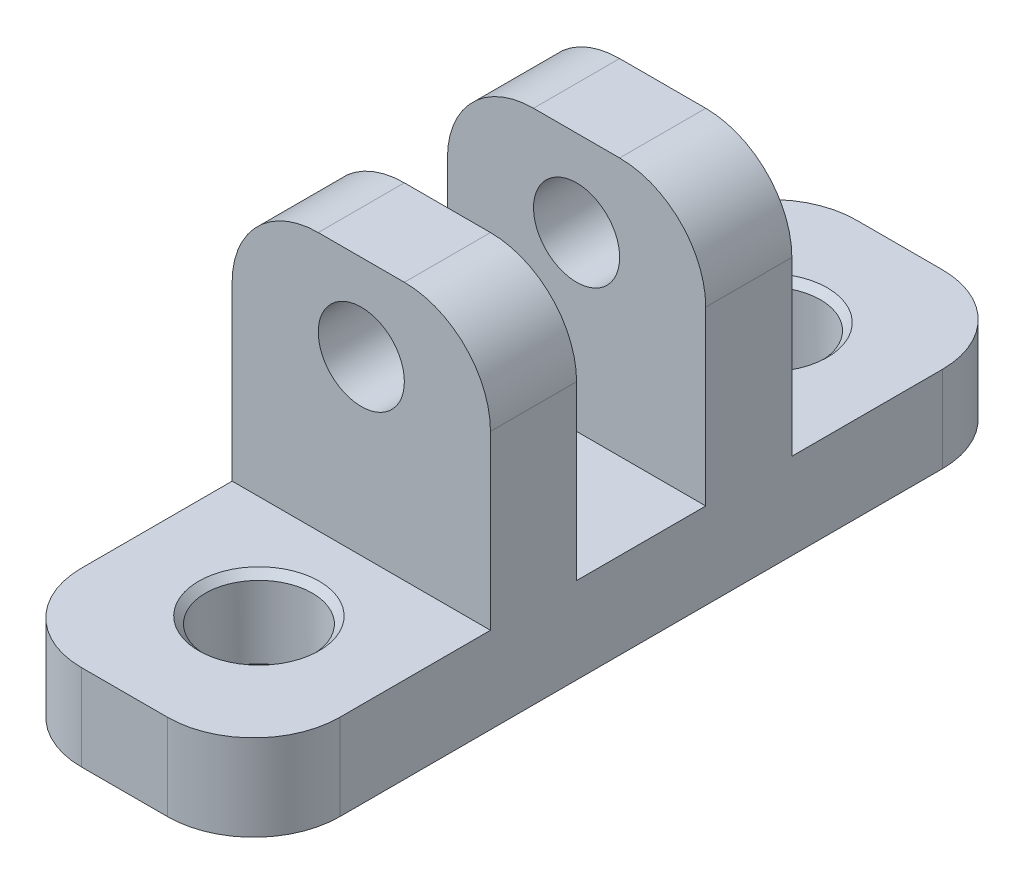
ISO-10303-21;
HEADER;
FILE_DESCRIPTION(('STEP AP214'),'2;1');
FILE_NAME('part.step','',(''),(''),'','','');
FILE_SCHEMA(('AUTOMOTIVE_DESIGN { 1 0 10303 214 1 1 1 1 }'));
ENDSEC;
DATA;
#1=APPLICATION_CONTEXT('core data for automotive mechanical design processes');
#2=APPLICATION_PROTOCOL_DEFINITION('international standard','automotive_design',2000,#1);
#3=PRODUCT_CONTEXT('',#1,'mechanical');
#4=PRODUCT('Part','Part','',(#3));
#5=PRODUCT_RELATED_PRODUCT_CATEGORY('part','',(#4));
#6=PRODUCT_DEFINITION_FORMATION('','',#4);
#7=PRODUCT_DEFINITION_CONTEXT('part definition',#1,'design');
#8=PRODUCT_DEFINITION('design','',#6,#7);
#9=PRODUCT_DEFINITION_SHAPE('','',#8);
#10=(LENGTH_UNIT() NAMED_UNIT(*) SI_UNIT(.MILLI.,.METRE.));
#11=(NAMED_UNIT(*) PLANE_ANGLE_UNIT() SI_UNIT($,.RADIAN.));
#12=(NAMED_UNIT(*) SI_UNIT($,.STERADIAN.) SOLID_ANGLE_UNIT());
#13=UNCERTAINTY_MEASURE_WITH_UNIT(LENGTH_MEASURE(1.E-05),#10,'distance_accuracy_value','');
#14=(GEOMETRIC_REPRESENTATION_CONTEXT(3) GLOBAL_UNCERTAINTY_ASSIGNED_CONTEXT((#13)) GLOBAL_UNIT_ASSIGNED_CONTEXT((#10,
#11,#12)) REPRESENTATION_CONTEXT('',''));
#15=CARTESIAN_POINT('',(0.,0.,0.));
#16=DIRECTION('',(0.,0.,1.));
#17=DIRECTION('',(1.,0.,0.));
#18=AXIS2_PLACEMENT_3D('',#15,#16,#17);
#19=CARTESIAN_POINT('',(0.,25.4,0.));
#20=DIRECTION('',(0.,1.,0.));
#21=DIRECTION('',(0.,0.,1.));
#22=AXIS2_PLACEMENT_3D('',#19,#20,#21);
#23=PLANE('',#22);
#24=DIRECTION('',(1.,0.,0.));
#25=VECTOR('',#24,1.);
#26=CARTESIAN_POINT('',(60.325,25.4,4.76249999999999));
#27=LINE('',#26,#25);
#28=CARTESIAN_POINT('',(66.675,25.4,4.76249999999999));
#29=VERTEX_POINT('',#28);
#30=CARTESIAN_POINT('',(73.025,25.4,4.76249999999999));
#31=VERTEX_POINT('',#30);
#32=EDGE_CURVE('E209',#29,#31,#27,.T.);
#33=ORIENTED_EDGE('',*,*,#32,.F.);
#34=DIRECTION('',(0.,0.,1.));
#35=VECTOR('',#34,1.);
#36=CARTESIAN_POINT('',(66.675,25.4,11.1125));
#37=LINE('',#36,#35);
#38=CARTESIAN_POINT('',(66.675,25.4,11.1125));
#39=VERTEX_POINT('',#38);
#40=EDGE_CURVE('E327',#29,#39,#37,.T.);
#41=ORIENTED_EDGE('',*,*,#40,.T.);
#42=DIRECTION('',(1.,0.,0.));
#43=VECTOR('',#42,1.);
#44=CARTESIAN_POINT('',(60.325,25.4,11.1125));
#45=LINE('',#44,#43);
#46=CARTESIAN_POINT('',(73.025,25.4,11.1125));
#47=VERTEX_POINT('',#46);
#48=EDGE_CURVE('E243',#39,#47,#45,.T.);
#49=ORIENTED_EDGE('',*,*,#48,.T.);
#50=DIRECTION('',(0.,0.,-1.));
#51=VECTOR('',#50,1.);
#52=CARTESIAN_POINT('',(73.025,25.4,4.76249999999999));
#53=LINE('',#52,#51);
#54=EDGE_CURVE('E324',#47,#31,#53,.T.);
#55=ORIENTED_EDGE('',*,*,#54,.T.);
#56=EDGE_LOOP('',(#33,#41,#49,#55));
#57=FACE_BOUND('',#56,.T.);
#58=ADVANCED_FACE('F33',(#57),#23,.T.);
#59=CARTESIAN_POINT('',(60.325,25.4,-28.575));
#60=DIRECTION('',(1.,0.,0.));
#61=DIRECTION('',(0.,0.,-1.));
#62=AXIS2_PLACEMENT_3D('',#59,#60,#61);
#63=PLANE('',#62);
#64=DIRECTION('',(0.,0.,-1.));
#65=VECTOR('',#64,1.);
#66=CARTESIAN_POINT('',(60.325,6.35,-28.575));
#67=LINE('',#66,#65);
#68=CARTESIAN_POINT('',(60.325,6.35,-11.1125));
#69=VERTEX_POINT('',#68);
#70=CARTESIAN_POINT('',(60.325,6.35,-22.225));
#71=VERTEX_POINT('',#70);
#72=EDGE_CURVE('E219',#69,#71,#67,.T.);
#73=ORIENTED_EDGE('',*,*,#72,.T.);
#74=DIRECTION('',(0.,-1.,0.));
#75=VECTOR('',#74,1.);
#76=CARTESIAN_POINT('',(60.325,25.4,-22.225));
#77=LINE('',#76,#75);
#78=CARTESIAN_POINT('',(60.325,0.,-22.225));
#79=VERTEX_POINT('',#78);
#80=EDGE_CURVE('E272',#71,#79,#77,.T.);
#81=ORIENTED_EDGE('',*,*,#80,.T.);
#82=DIRECTION('',(0.,0.,1.));
#83=VECTOR('',#82,1.);
#84=CARTESIAN_POINT('',(60.325,0.,-28.575));
#85=LINE('',#84,#83);
#86=CARTESIAN_POINT('',(60.325,0.,22.225));
#87=VERTEX_POINT('',#86);
#88=EDGE_CURVE('E245',#79,#87,#85,.T.);
#89=ORIENTED_EDGE('',*,*,#88,.T.);
#90=DIRECTION('',(0.,-1.,0.));
#91=VECTOR('',#90,1.);
#92=CARTESIAN_POINT('',(60.325,25.4,22.225));
#93=LINE('',#92,#91);
#94=CARTESIAN_POINT('',(60.325,6.35,22.225));
#95=VERTEX_POINT('',#94);
#96=EDGE_CURVE('E270',#87,#95,#93,.F.);
#97=ORIENTED_EDGE('',*,*,#96,.T.);
#98=DIRECTION('',(0.,0.,-1.));
#99=VECTOR('',#98,1.);
#100=CARTESIAN_POINT('',(60.325,6.35,28.575));
#101=LINE('',#100,#99);
#102=CARTESIAN_POINT('',(60.325,6.35,11.1125));
#103=VERTEX_POINT('',#102);
#104=EDGE_CURVE('E235',#95,#103,#101,.T.);
#105=ORIENTED_EDGE('',*,*,#104,.T.);
#106=DIRECTION('',(0.,1.,0.));
#107=VECTOR('',#106,1.);
#108=CARTESIAN_POINT('',(60.325,25.4,11.1125));
#109=LINE('',#108,#107);
#110=CARTESIAN_POINT('',(60.325,19.05,11.1125));
#111=VERTEX_POINT('',#110);
#112=EDGE_CURVE('E237',#103,#111,#109,.T.);
#113=ORIENTED_EDGE('',*,*,#112,.T.);
#114=DIRECTION('',(0.,0.,1.));
#115=VECTOR('',#114,1.);
#116=CARTESIAN_POINT('',(60.325,19.05,4.76249999999999));
#117=LINE('',#116,#115);
#118=CARTESIAN_POINT('',(60.325,19.05,4.7625));
#119=VERTEX_POINT('',#118);
#120=EDGE_CURVE('E181',#111,#119,#117,.F.);
#121=ORIENTED_EDGE('',*,*,#120,.T.);
#122=DIRECTION('',(0.,-1.,0.));
#123=VECTOR('',#122,1.);
#124=CARTESIAN_POINT('',(60.325,25.4,4.76249999999999));
#125=LINE('',#124,#123);
#126=CARTESIAN_POINT('',(60.325,6.35,4.76250000000004));
#127=VERTEX_POINT('',#126);
#128=EDGE_CURVE('E173',#119,#127,#125,.T.);
#129=ORIENTED_EDGE('',*,*,#128,.T.);
#130=DIRECTION('',(0.,0.,-1.));
#131=VECTOR('',#130,1.);
#132=CARTESIAN_POINT('',(60.325,6.35,4.76250000000004));
#133=LINE('',#132,#131);
#134=CARTESIAN_POINT('',(60.325,6.35,-4.76249999999996));
#135=VERTEX_POINT('',#134);
#136=EDGE_CURVE('E179',#127,#135,#133,.T.);
#137=ORIENTED_EDGE('',*,*,#136,.T.);
#138=DIRECTION('',(0.,1.,0.));
#139=VECTOR('',#138,1.);
#140=CARTESIAN_POINT('',(60.325,25.4,-4.76250000000001));
#141=LINE('',#140,#139);
#142=CARTESIAN_POINT('',(60.325,19.05,-4.76249999999999));
#143=VERTEX_POINT('',#142);
#144=EDGE_CURVE('E195',#135,#143,#141,.T.);
#145=ORIENTED_EDGE('',*,*,#144,.T.);
#146=DIRECTION('',(0.,0.,1.));
#147=VECTOR('',#146,1.);
#148=CARTESIAN_POINT('',(60.325,19.05,-11.1125));
#149=LINE('',#148,#147);
#150=CARTESIAN_POINT('',(60.325,19.05,-11.1125));
#151=VERTEX_POINT('',#150);
#152=EDGE_CURVE('E268',#143,#151,#149,.F.);
#153=ORIENTED_EDGE('',*,*,#152,.T.);
#154=DIRECTION('',(0.,-1.,0.));
#155=VECTOR('',#154,1.);
#156=CARTESIAN_POINT('',(60.325,25.4,-11.1125));
#157=LINE('',#156,#155);
#158=EDGE_CURVE('E217',#151,#69,#157,.T.);
#159=ORIENTED_EDGE('',*,*,#158,.T.);
#160=EDGE_LOOP('',(#73,#81,#89,#97,#105,#113,#121,#129,#137,#145,#153,#159));
#161=FACE_BOUND('',#160,.T.);
#162=ADVANCED_FACE('F176',(#161),#63,.F.);
#163=CARTESIAN_POINT('',(60.325,25.4,28.575));
#164=DIRECTION('',(0.,0.,-1.));
#165=DIRECTION('',(-1.,0.,0.));
#166=AXIS2_PLACEMENT_3D('',#163,#164,#165);
#167=PLANE('',#166);
#168=DIRECTION('',(1.,0.,0.));
#169=VECTOR('',#168,1.);
#170=CARTESIAN_POINT('',(60.325,6.35,28.575));
#171=LINE('',#170,#169);
#172=CARTESIAN_POINT('',(66.675,6.35,28.575));
#173=VERTEX_POINT('',#172);
#174=CARTESIAN_POINT('',(73.025,6.35,28.575));
#175=VERTEX_POINT('',#174);
#176=EDGE_CURVE('E240',#173,#175,#171,.T.);
#177=ORIENTED_EDGE('',*,*,#176,.F.);
#178=DIRECTION('',(0.,-1.,0.));
#179=VECTOR('',#178,1.);
#180=CARTESIAN_POINT('',(66.675,25.4,28.575));
#181=LINE('',#180,#179);
#182=CARTESIAN_POINT('',(66.675,0.,28.575));
#183=VERTEX_POINT('',#182);
#184=EDGE_CURVE('E303',#173,#183,#181,.T.);
#185=ORIENTED_EDGE('',*,*,#184,.T.);
#186=DIRECTION('',(1.,0.,0.));
#187=VECTOR('',#186,1.);
#188=CARTESIAN_POINT('',(60.325,0.,28.575));
#189=LINE('',#188,#187);
#190=CARTESIAN_POINT('',(73.025,0.,28.575));
#191=VERTEX_POINT('',#190);
#192=EDGE_CURVE('E253',#183,#191,#189,.T.);
#193=ORIENTED_EDGE('',*,*,#192,.T.);
#194=DIRECTION('',(0.,-1.,0.));
#195=VECTOR('',#194,1.);
#196=CARTESIAN_POINT('',(73.025,25.4,28.575));
#197=LINE('',#196,#195);
#198=EDGE_CURVE('E301',#191,#175,#197,.F.);
#199=ORIENTED_EDGE('',*,*,#198,.T.);
#200=EDGE_LOOP('',(#177,#185,#193,#199));
#201=FACE_BOUND('',#200,.T.);
#202=ADVANCED_FACE('F378',(#201),#167,.F.);
#203=CARTESIAN_POINT('',(79.375,25.4,-28.575));
#204=DIRECTION('',(-1.,0.,0.));
#205=DIRECTION('',(0.,0.,1.));
#206=AXIS2_PLACEMENT_3D('',#203,#204,#205);
#207=PLANE('',#206);
#208=DIRECTION('',(0.,0.,-1.));
#209=VECTOR('',#208,1.);
#210=CARTESIAN_POINT('',(79.375,0.,-28.575));
#211=LINE('',#210,#209);
#212=CARTESIAN_POINT('',(79.375,0.,22.225));
#213=VERTEX_POINT('',#212);
#214=CARTESIAN_POINT('',(79.375,0.,-22.225));
#215=VERTEX_POINT('',#214);
#216=EDGE_CURVE('E256',#213,#215,#211,.T.);
#217=ORIENTED_EDGE('',*,*,#216,.T.);
#218=DIRECTION('',(0.,-1.,0.));
#219=VECTOR('',#218,1.);
#220=CARTESIAN_POINT('',(79.375,25.4,-22.225));
#221=LINE('',#220,#219);
#222=CARTESIAN_POINT('',(79.375,6.35,-22.225));
#223=VERTEX_POINT('',#222);
#224=EDGE_CURVE('E299',#215,#223,#221,.F.);
#225=ORIENTED_EDGE('',*,*,#224,.T.);
#226=DIRECTION('',(0.,0.,-1.));
#227=VECTOR('',#226,1.);
#228=CARTESIAN_POINT('',(79.375,6.35,-28.575));
#229=LINE('',#228,#227);
#230=CARTESIAN_POINT('',(79.375,6.35,-11.1125));
#231=VERTEX_POINT('',#230);
#232=EDGE_CURVE('E220',#231,#223,#229,.T.);
#233=ORIENTED_EDGE('',*,*,#232,.F.);
#234=DIRECTION('',(0.,-1.,0.));
#235=VECTOR('',#234,1.);
#236=CARTESIAN_POINT('',(79.375,25.4,-11.1125));
#237=LINE('',#236,#235);
#238=CARTESIAN_POINT('',(79.375,19.05,-11.1125));
#239=VERTEX_POINT('',#238);
#240=EDGE_CURVE('E223',#239,#231,#237,.T.);
#241=ORIENTED_EDGE('',*,*,#240,.F.);
#242=DIRECTION('',(0.,0.,-1.));
#243=VECTOR('',#242,1.);
#244=CARTESIAN_POINT('',(79.375,19.05,-4.76250000000001));
#245=LINE('',#244,#243);
#246=CARTESIAN_POINT('',(79.375,19.05,-4.76249999999999));
#247=VERTEX_POINT('',#246);
#248=EDGE_CURVE('E294',#239,#247,#245,.F.);
#249=ORIENTED_EDGE('',*,*,#248,.T.);
#250=DIRECTION('',(0.,1.,0.));
#251=VECTOR('',#250,1.);
#252=CARTESIAN_POINT('',(79.375,25.4,-4.76250000000001));
#253=LINE('',#252,#251);
#254=CARTESIAN_POINT('',(79.375,6.35,-4.76249999999996));
#255=VERTEX_POINT('',#254);
#256=EDGE_CURVE('E184',#255,#247,#253,.T.);
#257=ORIENTED_EDGE('',*,*,#256,.F.);
#258=DIRECTION('',(0.,0.,-1.));
#259=VECTOR('',#258,1.);
#260=CARTESIAN_POINT('',(79.375,6.35,4.76250000000004));
#261=LINE('',#260,#259);
#262=CARTESIAN_POINT('',(79.375,6.35,4.76250000000004));
#263=VERTEX_POINT('',#262);
#264=EDGE_CURVE('E204',#263,#255,#261,.T.);
#265=ORIENTED_EDGE('',*,*,#264,.F.);
#266=DIRECTION('',(0.,-1.,0.));
#267=VECTOR('',#266,1.);
#268=CARTESIAN_POINT('',(79.375,25.4,4.76249999999999));
#269=LINE('',#268,#267);
#270=CARTESIAN_POINT('',(79.375,19.05,4.7625));
#271=VERTEX_POINT('',#270);
#272=EDGE_CURVE('E190',#271,#263,#269,.T.);
#273=ORIENTED_EDGE('',*,*,#272,.F.);
#274=DIRECTION('',(0.,0.,-1.));
#275=VECTOR('',#274,1.);
#276=CARTESIAN_POINT('',(79.375,19.05,11.1125));
#277=LINE('',#276,#275);
#278=CARTESIAN_POINT('',(79.375,19.05,11.1125));
#279=VERTEX_POINT('',#278);
#280=EDGE_CURVE('E292',#271,#279,#277,.F.);
#281=ORIENTED_EDGE('',*,*,#280,.T.);
#282=DIRECTION('',(0.,1.,0.));
#283=VECTOR('',#282,1.);
#284=CARTESIAN_POINT('',(79.375,25.4,11.1125));
#285=LINE('',#284,#283);
#286=CARTESIAN_POINT('',(79.375,6.35,11.1125));
#287=VERTEX_POINT('',#286);
#288=EDGE_CURVE('E238',#287,#279,#285,.T.);
#289=ORIENTED_EDGE('',*,*,#288,.F.);
#290=DIRECTION('',(0.,0.,-1.));
#291=VECTOR('',#290,1.);
#292=CARTESIAN_POINT('',(79.375,6.35,28.575));
#293=LINE('',#292,#291);
#294=CARTESIAN_POINT('',(79.375,6.35,22.225));
#295=VERTEX_POINT('',#294);
#296=EDGE_CURVE('E212',#295,#287,#293,.T.);
#297=ORIENTED_EDGE('',*,*,#296,.F.);
#298=DIRECTION('',(0.,-1.,0.));
#299=VECTOR('',#298,1.);
#300=CARTESIAN_POINT('',(79.375,25.4,22.225));
#301=LINE('',#300,#299);
#302=EDGE_CURVE('E296',#295,#213,#301,.T.);
#303=ORIENTED_EDGE('',*,*,#302,.T.);
#304=EDGE_LOOP('',(#217,#225,#233,#241,#249,#257,#265,#273,#281,#289,#297,#303));
#305=FACE_BOUND('',#304,.T.);
#306=ADVANCED_FACE('F394',(#305),#207,.F.);
#307=CARTESIAN_POINT('',(60.325,25.4,-28.575));
#308=DIRECTION('',(0.,0.,1.));
#309=DIRECTION('',(1.,0.,0.));
#310=AXIS2_PLACEMENT_3D('',#307,#308,#309);
#311=PLANE('',#310);
#312=DIRECTION('',(-1.,0.,0.));
#313=VECTOR('',#312,1.);
#314=CARTESIAN_POINT('',(60.325,0.,-28.575));
#315=LINE('',#314,#313);
#316=CARTESIAN_POINT('',(73.025,0.,-28.575));
#317=VERTEX_POINT('',#316);
#318=CARTESIAN_POINT('',(66.675,0.,-28.575));
#319=VERTEX_POINT('',#318);
#320=EDGE_CURVE('E259',#317,#319,#315,.T.);
#321=ORIENTED_EDGE('',*,*,#320,.T.);
#322=DIRECTION('',(0.,-1.,0.));
#323=VECTOR('',#322,1.);
#324=CARTESIAN_POINT('',(66.675,25.4,-28.575));
#325=LINE('',#324,#323);
#326=CARTESIAN_POINT('',(66.675,6.35,-28.575));
#327=VERTEX_POINT('',#326);
#328=EDGE_CURVE('E286',#319,#327,#325,.F.);
#329=ORIENTED_EDGE('',*,*,#328,.T.);
#330=DIRECTION('',(1.,0.,0.));
#331=VECTOR('',#330,1.);
#332=CARTESIAN_POINT('',(60.325,6.35,-28.575));
#333=LINE('',#332,#331);
#334=CARTESIAN_POINT('',(73.025,6.35,-28.575));
#335=VERTEX_POINT('',#334);
#336=EDGE_CURVE('E205',#327,#335,#333,.T.);
#337=ORIENTED_EDGE('',*,*,#336,.T.);
#338=DIRECTION('',(0.,-1.,0.));
#339=VECTOR('',#338,1.);
#340=CARTESIAN_POINT('',(73.025,25.4,-28.575));
#341=LINE('',#340,#339);
#342=EDGE_CURVE('E283',#335,#317,#341,.T.);
#343=ORIENTED_EDGE('',*,*,#342,.T.);
#344=EDGE_LOOP('',(#321,#329,#337,#343));
#345=FACE_BOUND('',#344,.T.);
#346=ADVANCED_FACE('F385',(#345),#311,.F.);
#347=DIRECTION('',(1.,0.,0.));
#348=VECTOR('',#347,1.);
#349=CARTESIAN_POINT('',(60.325,25.4,-4.76250000000001));
#350=LINE('',#349,#348);
#351=CARTESIAN_POINT('',(66.675,25.4,-4.76250000000001));
#352=VERTEX_POINT('',#351);
#353=CARTESIAN_POINT('',(73.025,25.4,-4.76250000000001));
#354=VERTEX_POINT('',#353);
#355=EDGE_CURVE('E213',#352,#354,#350,.T.);
#356=ORIENTED_EDGE('',*,*,#355,.T.);
#357=DIRECTION('',(0.,0.,-1.));
#358=VECTOR('',#357,1.);
#359=CARTESIAN_POINT('',(73.025,25.4,-11.1125));
#360=LINE('',#359,#358);
#361=CARTESIAN_POINT('',(73.025,25.4,-11.1125));
#362=VERTEX_POINT('',#361);
#363=EDGE_CURVE('E313',#354,#362,#360,.T.);
#364=ORIENTED_EDGE('',*,*,#363,.T.);
#365=DIRECTION('',(1.,0.,0.));
#366=VECTOR('',#365,1.);
#367=CARTESIAN_POINT('',(60.325,25.4,-11.1125));
#368=LINE('',#367,#366);
#369=CARTESIAN_POINT('',(66.675,25.4,-11.1125));
#370=VERTEX_POINT('',#369);
#371=EDGE_CURVE('E222',#370,#362,#368,.T.);
#372=ORIENTED_EDGE('',*,*,#371,.F.);
#373=DIRECTION('',(0.,0.,1.));
#374=VECTOR('',#373,1.);
#375=CARTESIAN_POINT('',(66.675,25.4,-4.76250000000001));
#376=LINE('',#375,#374);
#377=EDGE_CURVE('E310',#370,#352,#376,.T.);
#378=ORIENTED_EDGE('',*,*,#377,.T.);
#379=EDGE_LOOP('',(#356,#364,#372,#378));
#380=FACE_BOUND('',#379,.T.);
#381=ADVANCED_FACE('F374',(#380),#23,.T.);
#382=CARTESIAN_POINT('',(0.,0.,0.));
#383=DIRECTION('',(0.,1.,0.));
#384=DIRECTION('',(0.,0.,1.));
#385=AXIS2_PLACEMENT_3D('',#382,#383,#384);
#386=PLANE('',#385);
#387=CARTESIAN_POINT('',(69.9233705650656,0.,-18.7359106749715));
#388=DIRECTION('',(0.,1.,0.));
#389=DIRECTION('',(0.,0.,1.));
#390=AXIS2_PLACEMENT_3D('',#387,#388,#389);
#391=CIRCLE('',#390,4.445);
#392=CARTESIAN_POINT('',(69.9233705650656,0.,-14.2909106749715));
#393=VERTEX_POINT('',#392);
#394=EDGE_CURVE('E347',#393,#393,#391,.T.);
#395=ORIENTED_EDGE('',*,*,#394,.T.);
#396=EDGE_LOOP('',(#395));
#397=FACE_BOUND('',#396,.T.);
#398=CARTESIAN_POINT('',(69.9233705650656,0.,18.7359106749715));
#399=DIRECTION('',(0.,1.,0.));
#400=DIRECTION('',(0.,0.,1.));
#401=AXIS2_PLACEMENT_3D('',#398,#399,#400);
#402=CIRCLE('',#401,4.445);
#403=CARTESIAN_POINT('',(69.9233705650656,0.,23.1809106749715));
#404=VERTEX_POINT('',#403);
#405=EDGE_CURVE('E344',#404,#404,#402,.T.);
#406=ORIENTED_EDGE('',*,*,#405,.T.);
#407=EDGE_LOOP('',(#406));
#408=FACE_BOUND('',#407,.T.);
#409=ORIENTED_EDGE('',*,*,#88,.F.);
#410=CARTESIAN_POINT('',(66.675,0.,-22.225));
#411=DIRECTION('',(0.,1.,0.));
#412=DIRECTION('',(0.,0.,1.));
#413=AXIS2_PLACEMENT_3D('',#410,#411,#412);
#414=CIRCLE('',#413,6.35);
#415=EDGE_CURVE('E281',#79,#319,#414,.F.);
#416=ORIENTED_EDGE('',*,*,#415,.T.);
#417=ORIENTED_EDGE('',*,*,#320,.F.);
#418=CARTESIAN_POINT('',(73.025,0.,-22.225));
#419=DIRECTION('',(0.,1.,0.));
#420=DIRECTION('',(0.,0.,1.));
#421=AXIS2_PLACEMENT_3D('',#418,#419,#420);
#422=CIRCLE('',#421,6.35);
#423=EDGE_CURVE('E279',#317,#215,#422,.F.);
#424=ORIENTED_EDGE('',*,*,#423,.T.);
#425=ORIENTED_EDGE('',*,*,#216,.F.);
#426=CARTESIAN_POINT('',(73.025,0.,22.225));
#427=DIRECTION('',(0.,1.,0.));
#428=DIRECTION('',(0.,0.,1.));
#429=AXIS2_PLACEMENT_3D('',#426,#427,#428);
#430=CIRCLE('',#429,6.35);
#431=EDGE_CURVE('E275',#213,#191,#430,.F.);
#432=ORIENTED_EDGE('',*,*,#431,.T.);
#433=ORIENTED_EDGE('',*,*,#192,.F.);
#434=CARTESIAN_POINT('',(66.675,0.,22.225));
#435=DIRECTION('',(0.,1.,0.));
#436=DIRECTION('',(0.,0.,1.));
#437=AXIS2_PLACEMENT_3D('',#434,#435,#436);
#438=CIRCLE('',#437,6.35);
#439=EDGE_CURVE('E277',#183,#87,#438,.F.);
#440=ORIENTED_EDGE('',*,*,#439,.T.);
#441=EDGE_LOOP('',(#409,#416,#417,#424,#425,#432,#433,#440));
#442=FACE_BOUND('',#441,.T.);
#443=ADVANCED_FACE('F384',(#397,#408,#442),#386,.F.);
#444=CARTESIAN_POINT('',(60.325,25.4,11.1125));
#445=DIRECTION('',(0.,0.,-1.));
#446=DIRECTION('',(0.,1.,0.));
#447=AXIS2_PLACEMENT_3D('',#444,#445,#446);
#448=PLANE('',#447);
#449=CARTESIAN_POINT('',(69.85,19.05,11.1125000000001));
#450=DIRECTION('',(0.,0.,1.));
#451=DIRECTION('',(1.,0.,0.));
#452=AXIS2_PLACEMENT_3D('',#449,#450,#451);
#453=CIRCLE('',#452,3.175);
#454=CARTESIAN_POINT('',(73.025,19.05,11.1125000000001));
#455=VERTEX_POINT('',#454);
#456=EDGE_CURVE('E266',#455,#455,#453,.T.);
#457=ORIENTED_EDGE('',*,*,#456,.F.);
#458=EDGE_LOOP('',(#457));
#459=FACE_BOUND('',#458,.T.);
#460=ORIENTED_EDGE('',*,*,#48,.F.);
#461=CARTESIAN_POINT('',(66.675,19.05,11.1125));
#462=DIRECTION('',(0.,0.,-1.));
#463=DIRECTION('',(0.,1.,0.));
#464=AXIS2_PLACEMENT_3D('',#461,#462,#463);
#465=CIRCLE('',#464,6.35);
#466=EDGE_CURVE('E56',#39,#111,#465,.F.);
#467=ORIENTED_EDGE('',*,*,#466,.T.);
#468=ORIENTED_EDGE('',*,*,#112,.F.);
#469=DIRECTION('',(1.,0.,0.));
#470=VECTOR('',#469,1.);
#471=CARTESIAN_POINT('',(60.325,6.35,11.1125));
#472=LINE('',#471,#470);
#473=EDGE_CURVE('E246',#103,#287,#472,.T.);
#474=ORIENTED_EDGE('',*,*,#473,.T.);
#475=ORIENTED_EDGE('',*,*,#288,.T.);
#476=CARTESIAN_POINT('',(73.025,19.05,11.1125));
#477=DIRECTION('',(0.,0.,-1.));
#478=DIRECTION('',(0.,1.,0.));
#479=AXIS2_PLACEMENT_3D('',#476,#477,#478);
#480=CIRCLE('',#479,6.35);
#481=EDGE_CURVE('E48',#279,#47,#480,.F.);
#482=ORIENTED_EDGE('',*,*,#481,.T.);
#483=EDGE_LOOP('',(#460,#467,#468,#474,#475,#482));
#484=FACE_BOUND('',#483,.T.);
#485=ADVANCED_FACE('F392',(#459,#484),#448,.F.);
#486=CARTESIAN_POINT('',(60.325,6.35,28.575));
#487=DIRECTION('',(0.,-1.,0.));
#488=DIRECTION('',(0.,0.,-1.));
#489=AXIS2_PLACEMENT_3D('',#486,#487,#488);
#490=PLANE('',#489);
#491=CARTESIAN_POINT('',(69.9233705650656,6.35,18.7359106749715));
#492=DIRECTION('',(0.,-1.,0.));
#493=DIRECTION('',(0.,0.,-1.));
#494=AXIS2_PLACEMENT_3D('',#491,#492,#493);
#495=CIRCLE('',#494,4.445);
#496=CARTESIAN_POINT('',(69.9233705650656,6.35,14.2909106749715));
#497=VERTEX_POINT('',#496);
#498=EDGE_CURVE('E11',#497,#497,#495,.T.);
#499=ORIENTED_EDGE('',*,*,#498,.T.);
#500=EDGE_LOOP('',(#499));
#501=FACE_BOUND('',#500,.T.);
#502=ORIENTED_EDGE('',*,*,#104,.F.);
#503=CARTESIAN_POINT('',(66.675,6.35,22.225));
#504=DIRECTION('',(0.,-1.,0.));
#505=DIRECTION('',(0.,0.,-1.));
#506=AXIS2_PLACEMENT_3D('',#503,#504,#505);
#507=CIRCLE('',#506,6.35);
#508=EDGE_CURVE('E308',#95,#173,#507,.F.);
#509=ORIENTED_EDGE('',*,*,#508,.T.);
#510=ORIENTED_EDGE('',*,*,#176,.T.);
#511=CARTESIAN_POINT('',(73.025,6.35,22.225));
#512=DIRECTION('',(0.,-1.,0.));
#513=DIRECTION('',(0.,0.,-1.));
#514=AXIS2_PLACEMENT_3D('',#511,#512,#513);
#515=CIRCLE('',#514,6.35);
#516=EDGE_CURVE('E306',#175,#295,#515,.F.);
#517=ORIENTED_EDGE('',*,*,#516,.T.);
#518=ORIENTED_EDGE('',*,*,#296,.T.);
#519=ORIENTED_EDGE('',*,*,#473,.F.);
#520=EDGE_LOOP('',(#502,#509,#510,#517,#518,#519));
#521=FACE_BOUND('',#520,.T.);
#522=ADVANCED_FACE('F449',(#501,#521),#490,.F.);
#523=CARTESIAN_POINT('',(60.325,6.35,-28.575));
#524=DIRECTION('',(0.,-1.,0.));
#525=DIRECTION('',(0.,0.,-1.));
#526=AXIS2_PLACEMENT_3D('',#523,#524,#525);
#527=PLANE('',#526);
#528=CARTESIAN_POINT('',(69.9233705650656,6.35,-18.7359106749715));
#529=DIRECTION('',(0.,-1.,0.));
#530=DIRECTION('',(0.,0.,-1.));
#531=AXIS2_PLACEMENT_3D('',#528,#529,#530);
#532=CIRCLE('',#531,4.445);
#533=CARTESIAN_POINT('',(69.9233705650656,6.35,-23.1809106749715));
#534=VERTEX_POINT('',#533);
#535=EDGE_CURVE('E341',#534,#534,#532,.T.);
#536=ORIENTED_EDGE('',*,*,#535,.T.);
#537=EDGE_LOOP('',(#536));
#538=FACE_BOUND('',#537,.T.);
#539=ORIENTED_EDGE('',*,*,#336,.F.);
#540=CARTESIAN_POINT('',(66.675,6.35,-22.225));
#541=DIRECTION('',(0.,-1.,0.));
#542=DIRECTION('',(0.,0.,-1.));
#543=AXIS2_PLACEMENT_3D('',#540,#541,#542);
#544=CIRCLE('',#543,6.35);
#545=EDGE_CURVE('E290',#327,#71,#544,.F.);
#546=ORIENTED_EDGE('',*,*,#545,.T.);
#547=ORIENTED_EDGE('',*,*,#72,.F.);
#548=DIRECTION('',(1.,0.,0.));
#549=VECTOR('',#548,1.);
#550=CARTESIAN_POINT('',(60.325,6.35,-11.1125));
#551=LINE('',#550,#549);
#552=EDGE_CURVE('E230',#69,#231,#551,.T.);
#553=ORIENTED_EDGE('',*,*,#552,.T.);
#554=ORIENTED_EDGE('',*,*,#232,.T.);
#555=CARTESIAN_POINT('',(73.025,6.35,-22.225));
#556=DIRECTION('',(0.,-1.,0.));
#557=DIRECTION('',(0.,0.,-1.));
#558=AXIS2_PLACEMENT_3D('',#555,#556,#557);
#559=CIRCLE('',#558,6.35);
#560=EDGE_CURVE('E288',#223,#335,#559,.F.);
#561=ORIENTED_EDGE('',*,*,#560,.T.);
#562=EDGE_LOOP('',(#539,#546,#547,#553,#554,#561));
#563=FACE_BOUND('',#562,.T.);
#564=ADVANCED_FACE('F417',(#538,#563),#527,.F.);
#565=CARTESIAN_POINT('',(60.325,25.4,-11.1125));
#566=DIRECTION('',(0.,0.,1.));
#567=DIRECTION('',(0.,-1.,0.));
#568=AXIS2_PLACEMENT_3D('',#565,#566,#567);
#569=PLANE('',#568);
#570=CARTESIAN_POINT('',(69.85,19.05,-11.1125));
#571=DIRECTION('',(0.,0.,1.));
#572=DIRECTION('',(0.,-1.,0.));
#573=AXIS2_PLACEMENT_3D('',#570,#571,#572);
#574=CIRCLE('',#573,3.175);
#575=CARTESIAN_POINT('',(69.85,15.875,-11.1125));
#576=VERTEX_POINT('',#575);
#577=EDGE_CURVE('E225',#576,#576,#574,.T.);
#578=ORIENTED_EDGE('',*,*,#577,.T.);
#579=EDGE_LOOP('',(#578));
#580=FACE_BOUND('',#579,.T.);
#581=ORIENTED_EDGE('',*,*,#371,.T.);
#582=CARTESIAN_POINT('',(73.025,19.05,-11.1125));
#583=DIRECTION('',(0.,0.,1.));
#584=DIRECTION('',(0.,-1.,0.));
#585=AXIS2_PLACEMENT_3D('',#582,#583,#584);
#586=CIRCLE('',#585,6.35);
#587=EDGE_CURVE('E318',#362,#239,#586,.F.);
#588=ORIENTED_EDGE('',*,*,#587,.T.);
#589=ORIENTED_EDGE('',*,*,#240,.T.);
#590=ORIENTED_EDGE('',*,*,#552,.F.);
#591=ORIENTED_EDGE('',*,*,#158,.F.);
#592=CARTESIAN_POINT('',(66.675,19.05,-11.1125));
#593=DIRECTION('',(0.,0.,1.));
#594=DIRECTION('',(0.,-1.,0.));
#595=AXIS2_PLACEMENT_3D('',#592,#593,#594);
#596=CIRCLE('',#595,6.35);
#597=EDGE_CURVE('E316',#151,#370,#596,.F.);
#598=ORIENTED_EDGE('',*,*,#597,.T.);
#599=EDGE_LOOP('',(#581,#588,#589,#590,#591,#598));
#600=FACE_BOUND('',#599,.T.);
#601=ADVANCED_FACE('F408',(#580,#600),#569,.F.);
#602=CARTESIAN_POINT('',(60.325,25.4,4.76249999999999));
#603=DIRECTION('',(0.,0.,1.));
#604=DIRECTION('',(0.,-1.,0.));
#605=AXIS2_PLACEMENT_3D('',#602,#603,#604);
#606=PLANE('',#605);
#607=CARTESIAN_POINT('',(69.85,19.05,4.7625));
#608=DIRECTION('',(0.,0.,1.));
#609=DIRECTION('',(0.,-1.,0.));
#610=AXIS2_PLACEMENT_3D('',#607,#608,#609);
#611=CIRCLE('',#610,3.175);
#612=CARTESIAN_POINT('',(69.85,15.875,4.76250000000001));
#613=VERTEX_POINT('',#612);
#614=EDGE_CURVE('E265',#613,#613,#611,.T.);
#615=ORIENTED_EDGE('',*,*,#614,.T.);
#616=EDGE_LOOP('',(#615));
#617=FACE_BOUND('',#616,.T.);
#618=ORIENTED_EDGE('',*,*,#128,.F.);
#619=CARTESIAN_POINT('',(66.675,19.05,4.7625));
#620=DIRECTION('',(0.,0.,1.));
#621=DIRECTION('',(0.,-1.,0.));
#622=AXIS2_PLACEMENT_3D('',#619,#620,#621);
#623=CIRCLE('',#622,6.35);
#624=EDGE_CURVE('E333',#119,#29,#623,.F.);
#625=ORIENTED_EDGE('',*,*,#624,.T.);
#626=ORIENTED_EDGE('',*,*,#32,.T.);
#627=CARTESIAN_POINT('',(73.025,19.05,4.7625));
#628=DIRECTION('',(0.,0.,1.));
#629=DIRECTION('',(0.,-1.,0.));
#630=AXIS2_PLACEMENT_3D('',#627,#628,#629);
#631=CIRCLE('',#630,6.35);
#632=EDGE_CURVE('E331',#31,#271,#631,.F.);
#633=ORIENTED_EDGE('',*,*,#632,.T.);
#634=ORIENTED_EDGE('',*,*,#272,.T.);
#635=DIRECTION('',(1.,0.,0.));
#636=VECTOR('',#635,1.);
#637=CARTESIAN_POINT('',(60.325,6.35,4.76250000000004));
#638=LINE('',#637,#636);
#639=EDGE_CURVE('E187',#127,#263,#638,.T.);
#640=ORIENTED_EDGE('',*,*,#639,.F.);
#641=EDGE_LOOP('',(#618,#625,#626,#633,#634,#640));
#642=FACE_BOUND('',#641,.T.);
#643=ADVANCED_FACE('F188',(#617,#642),#606,.F.);
#644=CARTESIAN_POINT('',(60.325,25.4,-4.76250000000001));
#645=DIRECTION('',(0.,0.,-1.));
#646=DIRECTION('',(0.,1.,0.));
#647=AXIS2_PLACEMENT_3D('',#644,#645,#646);
#648=PLANE('',#647);
#649=CARTESIAN_POINT('',(69.85,19.05,-4.7625));
#650=DIRECTION('',(0.,0.,-1.));
#651=DIRECTION('',(0.,1.,0.));
#652=AXIS2_PLACEMENT_3D('',#649,#650,#651);
#653=CIRCLE('',#652,3.175);
#654=CARTESIAN_POINT('',(69.85,22.225,-4.7625));
#655=VERTEX_POINT('',#654);
#656=EDGE_CURVE('E262',#655,#655,#653,.T.);
#657=ORIENTED_EDGE('',*,*,#656,.T.);
#658=EDGE_LOOP('',(#657));
#659=FACE_BOUND('',#658,.T.);
#660=ORIENTED_EDGE('',*,*,#256,.T.);
#661=CARTESIAN_POINT('',(73.025,19.05,-4.76249999999999));
#662=DIRECTION('',(0.,0.,-1.));
#663=DIRECTION('',(0.,1.,0.));
#664=AXIS2_PLACEMENT_3D('',#661,#662,#663);
#665=CIRCLE('',#664,6.35);
#666=EDGE_CURVE('E322',#247,#354,#665,.F.);
#667=ORIENTED_EDGE('',*,*,#666,.T.);
#668=ORIENTED_EDGE('',*,*,#355,.F.);
#669=CARTESIAN_POINT('',(66.675,19.05,-4.76249999999999));
#670=DIRECTION('',(0.,0.,-1.));
#671=DIRECTION('',(0.,1.,0.));
#672=AXIS2_PLACEMENT_3D('',#669,#670,#671);
#673=CIRCLE('',#672,6.35);
#674=EDGE_CURVE('E320',#352,#143,#673,.F.);
#675=ORIENTED_EDGE('',*,*,#674,.T.);
#676=ORIENTED_EDGE('',*,*,#144,.F.);
#677=DIRECTION('',(1.,0.,0.));
#678=VECTOR('',#677,1.);
#679=CARTESIAN_POINT('',(60.325,6.35,-4.76249999999996));
#680=LINE('',#679,#678);
#681=EDGE_CURVE('E194',#135,#255,#680,.T.);
#682=ORIENTED_EDGE('',*,*,#681,.T.);
#683=EDGE_LOOP('',(#660,#667,#668,#675,#676,#682));
#684=FACE_BOUND('',#683,.T.);
#685=ADVANCED_FACE('F437',(#659,#684),#648,.F.);
#686=CARTESIAN_POINT('',(60.325,6.35,4.76250000000004));
#687=DIRECTION('',(0.,-1.,0.));
#688=DIRECTION('',(0.,0.,-1.));
#689=AXIS2_PLACEMENT_3D('',#686,#687,#688);
#690=PLANE('',#689);
#691=ORIENTED_EDGE('',*,*,#264,.T.);
#692=ORIENTED_EDGE('',*,*,#681,.F.);
#693=ORIENTED_EDGE('',*,*,#136,.F.);
#694=ORIENTED_EDGE('',*,*,#639,.T.);
#695=EDGE_LOOP('',(#691,#692,#693,#694));
#696=FACE_BOUND('',#695,.T.);
#697=ADVANCED_FACE('F197',(#696),#690,.F.);
#698=CARTESIAN_POINT('',(69.85,19.05,-28.575));
#699=DIRECTION('',(0.,0.,1.));
#700=DIRECTION('',(1.,0.,0.));
#701=AXIS2_PLACEMENT_3D('',#698,#699,#700);
#702=CYLINDRICAL_SURFACE('',#701,3.175);
#703=ORIENTED_EDGE('',*,*,#656,.F.);
#704=EDGE_LOOP('',(#703));
#705=FACE_BOUND('',#704,.T.);
#706=ORIENTED_EDGE('',*,*,#577,.F.);
#707=EDGE_LOOP('',(#706));
#708=FACE_BOUND('',#707,.T.);
#709=ADVANCED_FACE('F527',(#705,#708),#702,.F.);
#710=ORIENTED_EDGE('',*,*,#456,.T.);
#711=EDGE_LOOP('',(#710));
#712=FACE_BOUND('',#711,.T.);
#713=ORIENTED_EDGE('',*,*,#614,.F.);
#714=EDGE_LOOP('',(#713));
#715=FACE_BOUND('',#714,.T.);
#716=ADVANCED_FACE('F529',(#712,#715),#702,.F.);
#717=CARTESIAN_POINT('',(66.675,25.4,-22.225));
#718=DIRECTION('',(0.,-1.,0.));
#719=DIRECTION('',(0.,0.,-1.));
#720=AXIS2_PLACEMENT_3D('',#717,#718,#719);
#721=CYLINDRICAL_SURFACE('',#720,6.35);
#722=ORIENTED_EDGE('',*,*,#545,.F.);
#723=ORIENTED_EDGE('',*,*,#328,.F.);
#724=ORIENTED_EDGE('',*,*,#415,.F.);
#725=ORIENTED_EDGE('',*,*,#80,.F.);
#726=EDGE_LOOP('',(#722,#723,#724,#725));
#727=FACE_BOUND('',#726,.T.);
#728=ADVANCED_FACE('F430',(#727),#721,.T.);
#729=CARTESIAN_POINT('',(73.025,25.4,-22.225));
#730=DIRECTION('',(0.,-1.,0.));
#731=DIRECTION('',(0.,0.,-1.));
#732=AXIS2_PLACEMENT_3D('',#729,#730,#731);
#733=CYLINDRICAL_SURFACE('',#732,6.35);
#734=ORIENTED_EDGE('',*,*,#560,.F.);
#735=ORIENTED_EDGE('',*,*,#224,.F.);
#736=ORIENTED_EDGE('',*,*,#423,.F.);
#737=ORIENTED_EDGE('',*,*,#342,.F.);
#738=EDGE_LOOP('',(#734,#735,#736,#737));
#739=FACE_BOUND('',#738,.T.);
#740=ADVANCED_FACE('F421',(#739),#733,.T.);
#741=CARTESIAN_POINT('',(66.675,25.4,22.225));
#742=DIRECTION('',(0.,-1.,0.));
#743=DIRECTION('',(0.,0.,-1.));
#744=AXIS2_PLACEMENT_3D('',#741,#742,#743);
#745=CYLINDRICAL_SURFACE('',#744,6.35);
#746=ORIENTED_EDGE('',*,*,#508,.F.);
#747=ORIENTED_EDGE('',*,*,#96,.F.);
#748=ORIENTED_EDGE('',*,*,#439,.F.);
#749=ORIENTED_EDGE('',*,*,#184,.F.);
#750=EDGE_LOOP('',(#746,#747,#748,#749));
#751=FACE_BOUND('',#750,.T.);
#752=ADVANCED_FACE('F461',(#751),#745,.T.);
#753=CARTESIAN_POINT('',(73.025,25.4,22.225));
#754=DIRECTION('',(0.,-1.,0.));
#755=DIRECTION('',(0.,0.,-1.));
#756=AXIS2_PLACEMENT_3D('',#753,#754,#755);
#757=CYLINDRICAL_SURFACE('',#756,6.35);
#758=ORIENTED_EDGE('',*,*,#516,.F.);
#759=ORIENTED_EDGE('',*,*,#198,.F.);
#760=ORIENTED_EDGE('',*,*,#431,.F.);
#761=ORIENTED_EDGE('',*,*,#302,.F.);
#762=EDGE_LOOP('',(#758,#759,#760,#761));
#763=FACE_BOUND('',#762,.T.);
#764=ADVANCED_FACE('F454',(#763),#757,.T.);
#765=CARTESIAN_POINT('',(73.025,19.05,0.));
#766=DIRECTION('',(0.,0.,1.));
#767=DIRECTION('',(1.,0.,0.));
#768=AXIS2_PLACEMENT_3D('',#765,#766,#767);
#769=CYLINDRICAL_SURFACE('',#768,6.35);
#770=ORIENTED_EDGE('',*,*,#666,.F.);
#771=ORIENTED_EDGE('',*,*,#248,.F.);
#772=ORIENTED_EDGE('',*,*,#587,.F.);
#773=ORIENTED_EDGE('',*,*,#363,.F.);
#774=EDGE_LOOP('',(#770,#771,#772,#773));
#775=FACE_BOUND('',#774,.T.);
#776=ADVANCED_FACE('F404',(#775),#769,.T.);
#777=CARTESIAN_POINT('',(66.675,19.05,0.));
#778=DIRECTION('',(0.,0.,-1.));
#779=DIRECTION('',(-1.,0.,0.));
#780=AXIS2_PLACEMENT_3D('',#777,#778,#779);
#781=CYLINDRICAL_SURFACE('',#780,6.35);
#782=ORIENTED_EDGE('',*,*,#597,.F.);
#783=ORIENTED_EDGE('',*,*,#152,.F.);
#784=ORIENTED_EDGE('',*,*,#674,.F.);
#785=ORIENTED_EDGE('',*,*,#377,.F.);
#786=EDGE_LOOP('',(#782,#783,#784,#785));
#787=FACE_BOUND('',#786,.T.);
#788=ADVANCED_FACE('F436',(#787),#781,.T.);
#789=CARTESIAN_POINT('',(66.675,19.05,0.));
#790=DIRECTION('',(0.,0.,-1.));
#791=DIRECTION('',(-1.,0.,0.));
#792=AXIS2_PLACEMENT_3D('',#789,#790,#791);
#793=CYLINDRICAL_SURFACE('',#792,6.35);
#794=ORIENTED_EDGE('',*,*,#624,.F.);
#795=ORIENTED_EDGE('',*,*,#120,.F.);
#796=ORIENTED_EDGE('',*,*,#466,.F.);
#797=ORIENTED_EDGE('',*,*,#40,.F.);
#798=EDGE_LOOP('',(#794,#795,#796,#797));
#799=FACE_BOUND('',#798,.T.);
#800=ADVANCED_FACE('F443',(#799),#793,.T.);
#801=CARTESIAN_POINT('',(73.025,19.05,0.));
#802=DIRECTION('',(0.,0.,1.));
#803=DIRECTION('',(1.,0.,0.));
#804=AXIS2_PLACEMENT_3D('',#801,#802,#803);
#805=CYLINDRICAL_SURFACE('',#804,6.35);
#806=ORIENTED_EDGE('',*,*,#481,.F.);
#807=ORIENTED_EDGE('',*,*,#280,.F.);
#808=ORIENTED_EDGE('',*,*,#632,.F.);
#809=ORIENTED_EDGE('',*,*,#54,.F.);
#810=EDGE_LOOP('',(#806,#807,#808,#809));
#811=FACE_BOUND('',#810,.T.);
#812=ADVANCED_FACE('F441',(#811),#805,.T.);
#813=CARTESIAN_POINT('',(69.9233705650656,6.35,18.7359106749715));
#814=DIRECTION('',(0.,1.,0.));
#815=DIRECTION('',(0.,0.,1.));
#816=AXIS2_PLACEMENT_3D('',#813,#814,#815);
#817=CYLINDRICAL_SURFACE('',#816,3.937);
#818=CARTESIAN_POINT('',(69.9233705650656,5.84199999999999,18.7359106749715));
#819=DIRECTION('',(0.,-1.,0.));
#820=DIRECTION('',(0.,0.,-1.));
#821=AXIS2_PLACEMENT_3D('',#818,#819,#820);
#822=CIRCLE('',#821,3.937);
#823=CARTESIAN_POINT('',(69.9233705650656,5.84199999999999,14.7989106749715));
#824=VERTEX_POINT('',#823);
#825=EDGE_CURVE('E41',#824,#824,#822,.F.);
#826=ORIENTED_EDGE('',*,*,#825,.T.);
#827=EDGE_LOOP('',(#826));
#828=FACE_BOUND('',#827,.T.);
#829=CARTESIAN_POINT('',(69.9233705650656,0.508000000000002,18.7359106749715));
#830=DIRECTION('',(0.,1.,0.));
#831=DIRECTION('',(0.,0.,1.));
#832=AXIS2_PLACEMENT_3D('',#829,#830,#831);
#833=CIRCLE('',#832,3.937);
#834=CARTESIAN_POINT('',(69.9233705650656,0.508000000000002,22.6729106749715));
#835=VERTEX_POINT('',#834);
#836=EDGE_CURVE('E350',#835,#835,#833,.F.);
#837=ORIENTED_EDGE('',*,*,#836,.T.);
#838=EDGE_LOOP('',(#837));
#839=FACE_BOUND('',#838,.T.);
#840=ADVANCED_FACE('F355',(#828,#839),#817,.F.);
#841=CARTESIAN_POINT('',(69.9233705650656,6.35,-18.7359106749715));
#842=DIRECTION('',(0.,1.,0.));
#843=DIRECTION('',(0.,0.,1.));
#844=AXIS2_PLACEMENT_3D('',#841,#842,#843);
#845=CYLINDRICAL_SURFACE('',#844,3.937);
#846=CARTESIAN_POINT('',(69.9233705650656,5.842,-18.7359106749715));
#847=DIRECTION('',(0.,-1.,0.));
#848=DIRECTION('',(0.,0.,-1.));
#849=AXIS2_PLACEMENT_3D('',#846,#847,#848);
#850=CIRCLE('',#849,3.937);
#851=CARTESIAN_POINT('',(69.9233705650656,5.842,-22.6729106749715));
#852=VERTEX_POINT('',#851);
#853=EDGE_CURVE('E338',#852,#852,#850,.F.);
#854=ORIENTED_EDGE('',*,*,#853,.T.);
#855=EDGE_LOOP('',(#854));
#856=FACE_BOUND('',#855,.T.);
#857=CARTESIAN_POINT('',(69.9233705650656,0.508000000000017,-18.7359106749715));
#858=DIRECTION('',(0.,1.,0.));
#859=DIRECTION('',(0.,0.,1.));
#860=AXIS2_PLACEMENT_3D('',#857,#858,#859);
#861=CIRCLE('',#860,3.937);
#862=CARTESIAN_POINT('',(69.9233705650656,0.508000000000017,-14.7989106749715));
#863=VERTEX_POINT('',#862);
#864=EDGE_CURVE('E335',#863,#863,#861,.F.);
#865=ORIENTED_EDGE('',*,*,#864,.T.);
#866=EDGE_LOOP('',(#865));
#867=FACE_BOUND('',#866,.T.);
#868=ADVANCED_FACE('F481',(#856,#867),#845,.F.);
#869=CARTESIAN_POINT('',(69.9233705650656,5.842,-18.7359106749715));
#870=DIRECTION('',(0.,1.,0.));
#871=DIRECTION('',(0.,0.,1.));
#872=AXIS2_PLACEMENT_3D('',#869,#870,#871);
#873=CONICAL_SURFACE('',#872,3.937,0.785398163397448);
#874=ORIENTED_EDGE('',*,*,#535,.F.);
#875=EDGE_LOOP('',(#874));
#876=FACE_BOUND('',#875,.T.);
#877=ORIENTED_EDGE('',*,*,#853,.F.);
#878=EDGE_LOOP('',(#877));
#879=FACE_BOUND('',#878,.T.);
#880=ADVANCED_FACE('F367',(#876,#879),#873,.F.);
#881=CARTESIAN_POINT('',(69.9233705650656,0.,-18.7359106749715));
#882=DIRECTION('',(0.,-1.,0.));
#883=DIRECTION('',(0.,0.,-1.));
#884=AXIS2_PLACEMENT_3D('',#881,#882,#883);
#885=CONICAL_SURFACE('',#884,4.445,0.78539816339744);
#886=ORIENTED_EDGE('',*,*,#864,.F.);
#887=EDGE_LOOP('',(#886));
#888=FACE_BOUND('',#887,.T.);
#889=ORIENTED_EDGE('',*,*,#394,.F.);
#890=EDGE_LOOP('',(#889));
#891=FACE_BOUND('',#890,.T.);
#892=ADVANCED_FACE('F360',(#888,#891),#885,.F.);
#893=CARTESIAN_POINT('',(69.9233705650656,5.84199999999999,18.7359106749715));
#894=DIRECTION('',(0.,1.,0.));
#895=DIRECTION('',(0.,0.,1.));
#896=AXIS2_PLACEMENT_3D('',#893,#894,#895);
#897=CONICAL_SURFACE('',#896,3.937,0.785398163397448);
#898=ORIENTED_EDGE('',*,*,#498,.F.);
#899=EDGE_LOOP('',(#898));
#900=FACE_BOUND('',#899,.T.);
#901=ORIENTED_EDGE('',*,*,#825,.F.);
#902=EDGE_LOOP('',(#901));
#903=FACE_BOUND('',#902,.T.);
#904=ADVANCED_FACE('F358',(#900,#903),#897,.F.);
#905=CARTESIAN_POINT('',(69.9233705650656,0.,18.7359106749715));
#906=DIRECTION('',(0.,-1.,0.));
#907=DIRECTION('',(0.,0.,-1.));
#908=AXIS2_PLACEMENT_3D('',#905,#906,#907);
#909=CONICAL_SURFACE('',#908,4.445,0.785398163397448);
#910=ORIENTED_EDGE('',*,*,#836,.F.);
#911=EDGE_LOOP('',(#910));
#912=FACE_BOUND('',#911,.T.);
#913=ORIENTED_EDGE('',*,*,#405,.F.);
#914=EDGE_LOOP('',(#913));
#915=FACE_BOUND('',#914,.T.);
#916=ADVANCED_FACE('F35',(#912,#915),#909,.F.);
#917=CLOSED_SHELL('',(#58,#162,#202,#306,#346,#381,#443,#485,#522,#564,#601,#643,#685,#697,#709,
#716,#728,#740,#752,#764,#776,#788,#800,#812,#840,#868,#880,#892,#904,#916));
#918=MANIFOLD_SOLID_BREP('B2',#917);
#919=ADVANCED_BREP_SHAPE_REPRESENTATION('',(#18,#918),#14);
#920=SHAPE_DEFINITION_REPRESENTATION(#9,#919);
ENDSEC;
END-ISO-10303-21;
